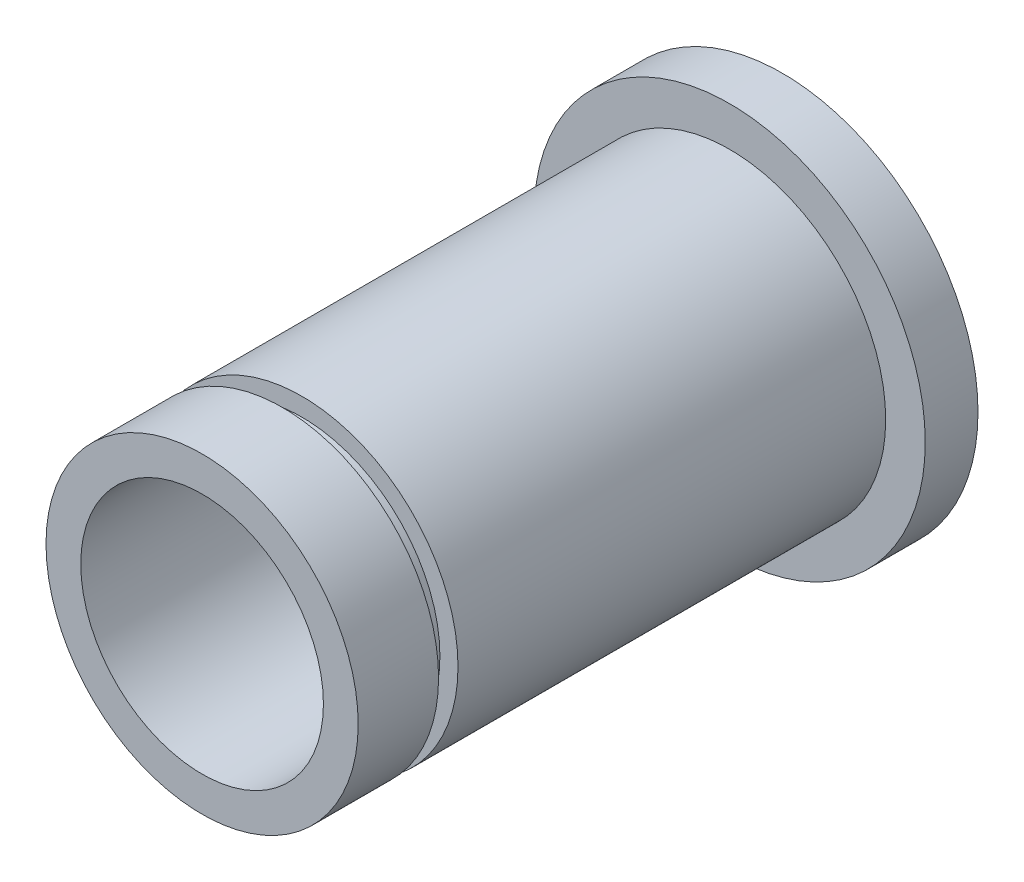
ISO-10303-21;
HEADER;
FILE_DESCRIPTION(('STEP AP214'),'2;1');
FILE_NAME('part.step','',(''),(''),'','','');
FILE_SCHEMA(('AUTOMOTIVE_DESIGN { 1 0 10303 214 1 1 1 1 }'));
ENDSEC;
DATA;
#1=APPLICATION_CONTEXT('core data for automotive mechanical design processes');
#2=APPLICATION_PROTOCOL_DEFINITION('international standard','automotive_design',2000,#1);
#3=PRODUCT_CONTEXT('',#1,'mechanical');
#4=PRODUCT('Part','Part','',(#3));
#5=PRODUCT_RELATED_PRODUCT_CATEGORY('part','',(#4));
#6=PRODUCT_DEFINITION_FORMATION('','',#4);
#7=PRODUCT_DEFINITION_CONTEXT('part definition',#1,'design');
#8=PRODUCT_DEFINITION('design','',#6,#7);
#9=PRODUCT_DEFINITION_SHAPE('','',#8);
#10=(LENGTH_UNIT() NAMED_UNIT(*) SI_UNIT(.MILLI.,.METRE.));
#11=(NAMED_UNIT(*) PLANE_ANGLE_UNIT() SI_UNIT($,.RADIAN.));
#12=(NAMED_UNIT(*) SI_UNIT($,.STERADIAN.) SOLID_ANGLE_UNIT());
#13=UNCERTAINTY_MEASURE_WITH_UNIT(LENGTH_MEASURE(1.E-05),#10,'distance_accuracy_value','');
#14=(GEOMETRIC_REPRESENTATION_CONTEXT(3) GLOBAL_UNCERTAINTY_ASSIGNED_CONTEXT((#13)) GLOBAL_UNIT_ASSIGNED_CONTEXT((#10,
#11,#12)) REPRESENTATION_CONTEXT('',''));
#15=CARTESIAN_POINT('',(0.,0.,0.));
#16=DIRECTION('',(0.,0.,1.));
#17=DIRECTION('',(1.,0.,0.));
#18=AXIS2_PLACEMENT_3D('',#15,#16,#17);
#19=CARTESIAN_POINT('',(0.,0.,0.));
#20=DIRECTION('',(0.,0.,1.));
#21=DIRECTION('',(1.,0.,0.));
#22=AXIS2_PLACEMENT_3D('',#19,#20,#21);
#23=CYLINDRICAL_SURFACE('',#22,4.6);
#24=CARTESIAN_POINT('',(0.,0.,-22.));
#25=DIRECTION('',(0.,0.,1.));
#26=DIRECTION('',(1.,0.,0.));
#27=AXIS2_PLACEMENT_3D('',#24,#25,#26);
#28=CIRCLE('',#27,4.6);
#29=CARTESIAN_POINT('',(4.6,0.,-22.));
#30=VERTEX_POINT('',#29);
#31=EDGE_CURVE('E65',#30,#30,#28,.T.);
#32=ORIENTED_EDGE('',*,*,#31,.F.);
#33=EDGE_LOOP('',(#32));
#34=FACE_BOUND('',#33,.T.);
#35=CARTESIAN_POINT('',(0.,0.,0.));
#36=DIRECTION('',(0.,0.,1.));
#37=DIRECTION('',(1.,0.,0.));
#38=AXIS2_PLACEMENT_3D('',#35,#36,#37);
#39=CIRCLE('',#38,4.6);
#40=CARTESIAN_POINT('',(4.6,0.,0.));
#41=VERTEX_POINT('',#40);
#42=EDGE_CURVE('E10',#41,#41,#39,.T.);
#43=ORIENTED_EDGE('',*,*,#42,.T.);
#44=EDGE_LOOP('',(#43));
#45=FACE_BOUND('',#44,.T.);
#46=ADVANCED_FACE('F31',(#34,#45),#23,.F.);
#47=CARTESIAN_POINT('',(0.,4.6,0.));
#48=DIRECTION('',(0.,0.,-1.));
#49=DIRECTION('',(-1.,0.,0.));
#50=AXIS2_PLACEMENT_3D('',#47,#48,#49);
#51=PLANE('',#50);
#52=ORIENTED_EDGE('',*,*,#42,.F.);
#53=EDGE_LOOP('',(#52));
#54=FACE_BOUND('',#53,.T.);
#55=CARTESIAN_POINT('',(0.,0.,0.));
#56=DIRECTION('',(0.,0.,1.));
#57=DIRECTION('',(1.,0.,0.));
#58=AXIS2_PLACEMENT_3D('',#55,#56,#57);
#59=CIRCLE('',#58,5.9182);
#60=CARTESIAN_POINT('',(5.9182,0.,0.));
#61=VERTEX_POINT('',#60);
#62=EDGE_CURVE('E37',#61,#61,#59,.T.);
#63=ORIENTED_EDGE('',*,*,#62,.T.);
#64=EDGE_LOOP('',(#63));
#65=FACE_BOUND('',#64,.T.);
#66=ADVANCED_FACE('F72',(#54,#65),#51,.F.);
#67=CARTESIAN_POINT('',(0.,0.,0.));
#68=DIRECTION('',(0.,0.,1.));
#69=DIRECTION('',(1.,0.,0.));
#70=AXIS2_PLACEMENT_3D('',#67,#68,#69);
#71=CYLINDRICAL_SURFACE('',#70,5.9182);
#72=ORIENTED_EDGE('',*,*,#62,.F.);
#73=EDGE_LOOP('',(#72));
#74=FACE_BOUND('',#73,.T.);
#75=CARTESIAN_POINT('',(0.,0.,-3.048));
#76=DIRECTION('',(0.,0.,1.));
#77=DIRECTION('',(1.,0.,0.));
#78=AXIS2_PLACEMENT_3D('',#75,#76,#77);
#79=CIRCLE('',#78,5.9182);
#80=CARTESIAN_POINT('',(5.9182,0.,-3.048));
#81=VERTEX_POINT('',#80);
#82=EDGE_CURVE('E41',#81,#81,#79,.T.);
#83=ORIENTED_EDGE('',*,*,#82,.T.);
#84=EDGE_LOOP('',(#83));
#85=FACE_BOUND('',#84,.T.);
#86=ADVANCED_FACE('F76',(#74,#85),#71,.T.);
#87=CARTESIAN_POINT('',(0.,5.2324,-3.048));
#88=DIRECTION('',(0.,0.,1.));
#89=DIRECTION('',(1.,0.,0.));
#90=AXIS2_PLACEMENT_3D('',#87,#88,#89);
#91=PLANE('',#90);
#92=ORIENTED_EDGE('',*,*,#82,.F.);
#93=EDGE_LOOP('',(#92));
#94=FACE_BOUND('',#93,.T.);
#95=CARTESIAN_POINT('',(0.,0.,-3.048));
#96=DIRECTION('',(0.,0.,1.));
#97=DIRECTION('',(1.,0.,0.));
#98=AXIS2_PLACEMENT_3D('',#95,#96,#97);
#99=CIRCLE('',#98,5.2324);
#100=CARTESIAN_POINT('',(5.2324,0.,-3.048));
#101=VERTEX_POINT('',#100);
#102=EDGE_CURVE('E45',#101,#101,#99,.T.);
#103=ORIENTED_EDGE('',*,*,#102,.T.);
#104=EDGE_LOOP('',(#103));
#105=FACE_BOUND('',#104,.T.);
#106=ADVANCED_FACE('F81',(#94,#105),#91,.F.);
#107=CARTESIAN_POINT('',(0.,0.,0.));
#108=DIRECTION('',(0.,0.,1.));
#109=DIRECTION('',(1.,0.,0.));
#110=AXIS2_PLACEMENT_3D('',#107,#108,#109);
#111=CYLINDRICAL_SURFACE('',#110,5.2324);
#112=ORIENTED_EDGE('',*,*,#102,.F.);
#113=EDGE_LOOP('',(#112));
#114=FACE_BOUND('',#113,.T.);
#115=CARTESIAN_POINT('',(0.,0.,-3.7846));
#116=DIRECTION('',(0.,0.,1.));
#117=DIRECTION('',(1.,0.,0.));
#118=AXIS2_PLACEMENT_3D('',#115,#116,#117);
#119=CIRCLE('',#118,5.2324);
#120=CARTESIAN_POINT('',(5.2324,0.,-3.7846));
#121=VERTEX_POINT('',#120);
#122=EDGE_CURVE('E50',#121,#121,#119,.T.);
#123=ORIENTED_EDGE('',*,*,#122,.T.);
#124=EDGE_LOOP('',(#123));
#125=FACE_BOUND('',#124,.T.);
#126=ADVANCED_FACE('F87',(#114,#125),#111,.T.);
#127=CARTESIAN_POINT('',(0.,5.9182,-3.7846));
#128=DIRECTION('',(0.,0.,-1.));
#129=DIRECTION('',(-1.,0.,0.));
#130=AXIS2_PLACEMENT_3D('',#127,#128,#129);
#131=PLANE('',#130);
#132=ORIENTED_EDGE('',*,*,#122,.F.);
#133=EDGE_LOOP('',(#132));
#134=FACE_BOUND('',#133,.T.);
#135=CARTESIAN_POINT('',(0.,0.,-3.7846));
#136=DIRECTION('',(0.,0.,1.));
#137=DIRECTION('',(1.,0.,0.));
#138=AXIS2_PLACEMENT_3D('',#135,#136,#137);
#139=CIRCLE('',#138,5.9182);
#140=CARTESIAN_POINT('',(5.9182,0.,-3.7846));
#141=VERTEX_POINT('',#140);
#142=EDGE_CURVE('E53',#141,#141,#139,.T.);
#143=ORIENTED_EDGE('',*,*,#142,.T.);
#144=EDGE_LOOP('',(#143));
#145=FACE_BOUND('',#144,.T.);
#146=ADVANCED_FACE('F91',(#134,#145),#131,.F.);
#147=CARTESIAN_POINT('',(0.,0.,0.));
#148=DIRECTION('',(0.,0.,1.));
#149=DIRECTION('',(1.,0.,0.));
#150=AXIS2_PLACEMENT_3D('',#147,#148,#149);
#151=CYLINDRICAL_SURFACE('',#150,5.9182);
#152=ORIENTED_EDGE('',*,*,#142,.F.);
#153=EDGE_LOOP('',(#152));
#154=FACE_BOUND('',#153,.T.);
#155=CARTESIAN_POINT('',(0.,0.,-20.));
#156=DIRECTION('',(0.,0.,1.));
#157=DIRECTION('',(1.,0.,0.));
#158=AXIS2_PLACEMENT_3D('',#155,#156,#157);
#159=CIRCLE('',#158,5.9182);
#160=CARTESIAN_POINT('',(5.9182,0.,-20.));
#161=VERTEX_POINT('',#160);
#162=EDGE_CURVE('E56',#161,#161,#159,.T.);
#163=ORIENTED_EDGE('',*,*,#162,.T.);
#164=EDGE_LOOP('',(#163));
#165=FACE_BOUND('',#164,.T.);
#166=ADVANCED_FACE('F95',(#154,#165),#151,.T.);
#167=CARTESIAN_POINT('',(0.,5.9182,-20.));
#168=DIRECTION('',(0.,0.,-1.));
#169=DIRECTION('',(-1.,0.,0.));
#170=AXIS2_PLACEMENT_3D('',#167,#168,#169);
#171=PLANE('',#170);
#172=ORIENTED_EDGE('',*,*,#162,.F.);
#173=EDGE_LOOP('',(#172));
#174=FACE_BOUND('',#173,.T.);
#175=CARTESIAN_POINT('',(0.,0.,-20.));
#176=DIRECTION('',(0.,0.,1.));
#177=DIRECTION('',(1.,0.,0.));
#178=AXIS2_PLACEMENT_3D('',#175,#176,#177);
#179=CIRCLE('',#178,7.4182);
#180=CARTESIAN_POINT('',(7.4182,0.,-20.));
#181=VERTEX_POINT('',#180);
#182=EDGE_CURVE('E59',#181,#181,#179,.T.);
#183=ORIENTED_EDGE('',*,*,#182,.T.);
#184=EDGE_LOOP('',(#183));
#185=FACE_BOUND('',#184,.T.);
#186=ADVANCED_FACE('F99',(#174,#185),#171,.F.);
#187=CARTESIAN_POINT('',(0.,0.,0.));
#188=DIRECTION('',(0.,0.,1.));
#189=DIRECTION('',(1.,0.,0.));
#190=AXIS2_PLACEMENT_3D('',#187,#188,#189);
#191=CYLINDRICAL_SURFACE('',#190,7.4182);
#192=ORIENTED_EDGE('',*,*,#182,.F.);
#193=EDGE_LOOP('',(#192));
#194=FACE_BOUND('',#193,.T.);
#195=CARTESIAN_POINT('',(0.,0.,-22.));
#196=DIRECTION('',(0.,0.,1.));
#197=DIRECTION('',(1.,0.,0.));
#198=AXIS2_PLACEMENT_3D('',#195,#196,#197);
#199=CIRCLE('',#198,7.4182);
#200=CARTESIAN_POINT('',(7.4182,0.,-22.));
#201=VERTEX_POINT('',#200);
#202=EDGE_CURVE('E62',#201,#201,#199,.T.);
#203=ORIENTED_EDGE('',*,*,#202,.T.);
#204=EDGE_LOOP('',(#203));
#205=FACE_BOUND('',#204,.T.);
#206=ADVANCED_FACE('F103',(#194,#205),#191,.T.);
#207=CARTESIAN_POINT('',(0.,7.4182,-22.));
#208=DIRECTION('',(0.,0.,1.));
#209=DIRECTION('',(1.,0.,0.));
#210=AXIS2_PLACEMENT_3D('',#207,#208,#209);
#211=PLANE('',#210);
#212=ORIENTED_EDGE('',*,*,#202,.F.);
#213=EDGE_LOOP('',(#212));
#214=FACE_BOUND('',#213,.T.);
#215=ORIENTED_EDGE('',*,*,#31,.T.);
#216=EDGE_LOOP('',(#215));
#217=FACE_BOUND('',#216,.T.);
#218=ADVANCED_FACE('F69',(#214,#217),#211,.F.);
#219=CLOSED_SHELL('',(#46,#66,#86,#106,#126,#146,#166,#186,#206,#218));
#220=MANIFOLD_SOLID_BREP('B2',#219);
#221=ADVANCED_BREP_SHAPE_REPRESENTATION('',(#18,#220),#14);
#222=SHAPE_DEFINITION_REPRESENTATION(#9,#221);
ENDSEC;
END-ISO-10303-21;
